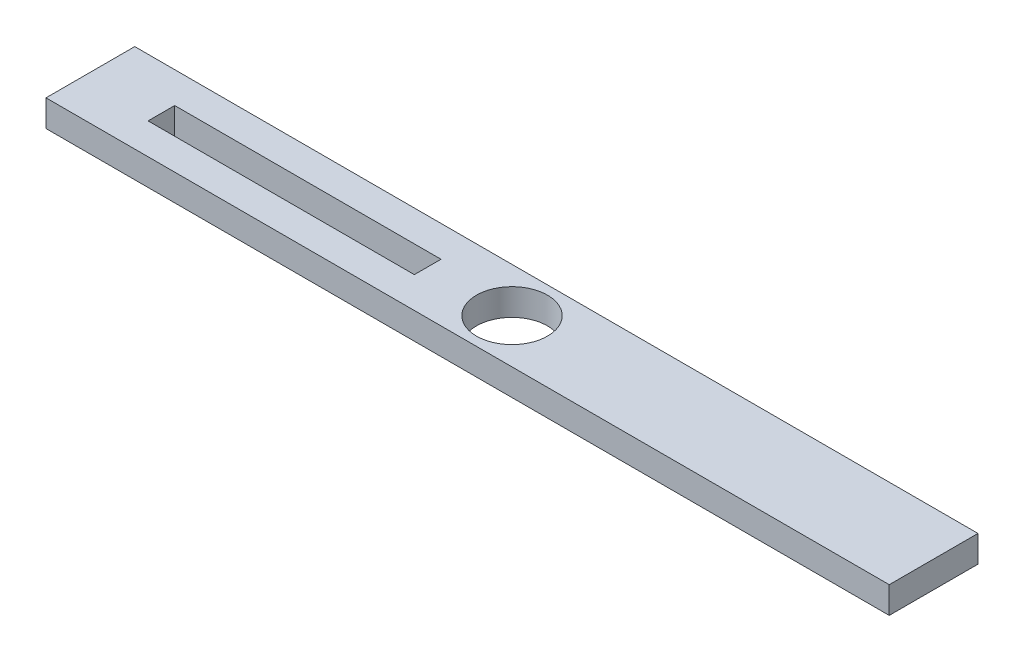
ISO-10303-21;
HEADER;
FILE_DESCRIPTION(('STEP AP214'),'2;1');
FILE_NAME('part.step','',(''),(''),'','','');
FILE_SCHEMA(('AUTOMOTIVE_DESIGN { 1 0 10303 214 1 1 1 1 }'));
ENDSEC;
DATA;
#1=APPLICATION_CONTEXT('core data for automotive mechanical design processes');
#2=APPLICATION_PROTOCOL_DEFINITION('international standard','automotive_design',2000,#1);
#3=PRODUCT_CONTEXT('',#1,'mechanical');
#4=PRODUCT('Part','Part','',(#3));
#5=PRODUCT_RELATED_PRODUCT_CATEGORY('part','',(#4));
#6=PRODUCT_DEFINITION_FORMATION('','',#4);
#7=PRODUCT_DEFINITION_CONTEXT('part definition',#1,'design');
#8=PRODUCT_DEFINITION('design','',#6,#7);
#9=PRODUCT_DEFINITION_SHAPE('','',#8);
#10=(LENGTH_UNIT() NAMED_UNIT(*) SI_UNIT(.MILLI.,.METRE.));
#11=(NAMED_UNIT(*) PLANE_ANGLE_UNIT() SI_UNIT($,.RADIAN.));
#12=(NAMED_UNIT(*) SI_UNIT($,.STERADIAN.) SOLID_ANGLE_UNIT());
#13=UNCERTAINTY_MEASURE_WITH_UNIT(LENGTH_MEASURE(1.E-05),#10,'distance_accuracy_value','');
#14=(GEOMETRIC_REPRESENTATION_CONTEXT(3) GLOBAL_UNCERTAINTY_ASSIGNED_CONTEXT((#13)) GLOBAL_UNIT_ASSIGNED_CONTEXT((#10,
#11,#12)) REPRESENTATION_CONTEXT('',''));
#15=CARTESIAN_POINT('',(0.,0.,0.));
#16=DIRECTION('',(0.,0.,1.));
#17=DIRECTION('',(1.,0.,0.));
#18=AXIS2_PLACEMENT_3D('',#15,#16,#17);
#19=CARTESIAN_POINT('',(0.,3.,0.));
#20=DIRECTION('',(0.,-1.,0.));
#21=DIRECTION('',(0.,0.,-1.));
#22=AXIS2_PLACEMENT_3D('',#19,#20,#21);
#23=PLANE('',#22);
#24=CARTESIAN_POINT('',(0.,3.,0.));
#25=DIRECTION('',(0.,1.,0.));
#26=DIRECTION('',(0.,0.,1.));
#27=AXIS2_PLACEMENT_3D('',#24,#25,#26);
#28=CIRCLE('',#27,4.);
#29=CARTESIAN_POINT('',(0.,3.,4.));
#30=VERTEX_POINT('',#29);
#31=EDGE_CURVE('E155',#30,#30,#28,.T.);
#32=ORIENTED_EDGE('',*,*,#31,.F.);
#33=EDGE_LOOP('',(#32));
#34=FACE_BOUND('',#33,.T.);
#35=DIRECTION('',(0.,0.,-1.));
#36=VECTOR('',#35,1.);
#37=CARTESIAN_POINT('',(47.5,3.,5.));
#38=LINE('',#37,#36);
#39=CARTESIAN_POINT('',(47.5,3.,5.));
#40=VERTEX_POINT('',#39);
#41=CARTESIAN_POINT('',(47.5,3.,-5.));
#42=VERTEX_POINT('',#41);
#43=EDGE_CURVE('E163',#40,#42,#38,.T.);
#44=ORIENTED_EDGE('',*,*,#43,.T.);
#45=DIRECTION('',(-1.,0.,0.));
#46=VECTOR('',#45,1.);
#47=CARTESIAN_POINT('',(-47.5,3.,-5.));
#48=LINE('',#47,#46);
#49=CARTESIAN_POINT('',(-47.5,3.,-5.));
#50=VERTEX_POINT('',#49);
#51=EDGE_CURVE('E167',#42,#50,#48,.T.);
#52=ORIENTED_EDGE('',*,*,#51,.T.);
#53=DIRECTION('',(0.,0.,1.));
#54=VECTOR('',#53,1.);
#55=CARTESIAN_POINT('',(-47.5,3.,5.));
#56=LINE('',#55,#54);
#57=CARTESIAN_POINT('',(-47.5,3.,5.));
#58=VERTEX_POINT('',#57);
#59=EDGE_CURVE('E171',#50,#58,#56,.T.);
#60=ORIENTED_EDGE('',*,*,#59,.T.);
#61=DIRECTION('',(1.,0.,0.));
#62=VECTOR('',#61,1.);
#63=CARTESIAN_POINT('',(-47.5,3.,5.));
#64=LINE('',#63,#62);
#65=EDGE_CURVE('E174',#58,#40,#64,.T.);
#66=ORIENTED_EDGE('',*,*,#65,.T.);
#67=EDGE_LOOP('',(#44,#52,#60,#66));
#68=FACE_BOUND('',#67,.T.);
#69=DIRECTION('',(0.,0.,-1.));
#70=VECTOR('',#69,1.);
#71=CARTESIAN_POINT('',(-9.50000000000001,3.,1.5));
#72=LINE('',#71,#70);
#73=CARTESIAN_POINT('',(-9.50000000000001,3.,1.5));
#74=VERTEX_POINT('',#73);
#75=CARTESIAN_POINT('',(-9.50000000000001,3.,-1.5));
#76=VERTEX_POINT('',#75);
#77=EDGE_CURVE('E107',#74,#76,#72,.T.);
#78=ORIENTED_EDGE('',*,*,#77,.F.);
#79=DIRECTION('',(1.,0.,0.));
#80=VECTOR('',#79,1.);
#81=CARTESIAN_POINT('',(-39.5,3.,1.5));
#82=LINE('',#81,#80);
#83=CARTESIAN_POINT('',(-39.5,3.,1.5));
#84=VERTEX_POINT('',#83);
#85=EDGE_CURVE('E133',#84,#74,#82,.T.);
#86=ORIENTED_EDGE('',*,*,#85,.F.);
#87=DIRECTION('',(0.,0.,1.));
#88=VECTOR('',#87,1.);
#89=CARTESIAN_POINT('',(-39.5,3.,1.5));
#90=LINE('',#89,#88);
#91=CARTESIAN_POINT('',(-39.5,3.,-1.5));
#92=VERTEX_POINT('',#91);
#93=EDGE_CURVE('E129',#92,#84,#90,.T.);
#94=ORIENTED_EDGE('',*,*,#93,.F.);
#95=DIRECTION('',(-1.,0.,0.));
#96=VECTOR('',#95,1.);
#97=CARTESIAN_POINT('',(-39.5,3.,-1.5));
#98=LINE('',#97,#96);
#99=EDGE_CURVE('E116',#76,#92,#98,.T.);
#100=ORIENTED_EDGE('',*,*,#99,.F.);
#101=EDGE_LOOP('',(#78,#86,#94,#100));
#102=FACE_BOUND('',#101,.T.);
#103=ADVANCED_FACE('F41',(#34,#68,#102),#23,.F.);
#104=CARTESIAN_POINT('',(0.,0.,0.));
#105=DIRECTION('',(0.,-1.,0.));
#106=DIRECTION('',(0.,0.,-1.));
#107=AXIS2_PLACEMENT_3D('',#104,#105,#106);
#108=PLANE('',#107);
#109=DIRECTION('',(0.,0.,-1.));
#110=VECTOR('',#109,1.);
#111=CARTESIAN_POINT('',(47.5,0.,5.));
#112=LINE('',#111,#110);
#113=CARTESIAN_POINT('',(47.5,0.,5.));
#114=VERTEX_POINT('',#113);
#115=CARTESIAN_POINT('',(47.5,0.,-5.));
#116=VERTEX_POINT('',#115);
#117=EDGE_CURVE('E159',#114,#116,#112,.T.);
#118=ORIENTED_EDGE('',*,*,#117,.F.);
#119=DIRECTION('',(1.,0.,0.));
#120=VECTOR('',#119,1.);
#121=CARTESIAN_POINT('',(-47.5,0.,5.));
#122=LINE('',#121,#120);
#123=CARTESIAN_POINT('',(-47.5,0.,5.));
#124=VERTEX_POINT('',#123);
#125=EDGE_CURVE('E168',#124,#114,#122,.T.);
#126=ORIENTED_EDGE('',*,*,#125,.F.);
#127=DIRECTION('',(0.,0.,1.));
#128=VECTOR('',#127,1.);
#129=CARTESIAN_POINT('',(-47.5,0.,5.));
#130=LINE('',#129,#128);
#131=CARTESIAN_POINT('',(-47.5,0.,-5.));
#132=VERTEX_POINT('',#131);
#133=EDGE_CURVE('E184',#132,#124,#130,.T.);
#134=ORIENTED_EDGE('',*,*,#133,.F.);
#135=DIRECTION('',(-1.,0.,0.));
#136=VECTOR('',#135,1.);
#137=CARTESIAN_POINT('',(-47.5,0.,-5.));
#138=LINE('',#137,#136);
#139=EDGE_CURVE('E181',#116,#132,#138,.T.);
#140=ORIENTED_EDGE('',*,*,#139,.F.);
#141=EDGE_LOOP('',(#118,#126,#134,#140));
#142=FACE_BOUND('',#141,.T.);
#143=CARTESIAN_POINT('',(0.,0.,0.));
#144=DIRECTION('',(0.,1.,0.));
#145=DIRECTION('',(0.,0.,1.));
#146=AXIS2_PLACEMENT_3D('',#143,#144,#145);
#147=CIRCLE('',#146,4.);
#148=CARTESIAN_POINT('',(0.,0.,4.));
#149=VERTEX_POINT('',#148);
#150=EDGE_CURVE('E125',#149,#149,#147,.T.);
#151=ORIENTED_EDGE('',*,*,#150,.T.);
#152=EDGE_LOOP('',(#151));
#153=FACE_BOUND('',#152,.T.);
#154=DIRECTION('',(1.,0.,0.));
#155=VECTOR('',#154,1.);
#156=CARTESIAN_POINT('',(-39.5,0.,1.5));
#157=LINE('',#156,#155);
#158=CARTESIAN_POINT('',(-39.5,0.,1.5));
#159=VERTEX_POINT('',#158);
#160=CARTESIAN_POINT('',(-9.50000000000001,0.,1.5));
#161=VERTEX_POINT('',#160);
#162=EDGE_CURVE('E117',#159,#161,#157,.T.);
#163=ORIENTED_EDGE('',*,*,#162,.T.);
#164=DIRECTION('',(0.,0.,-1.));
#165=VECTOR('',#164,1.);
#166=CARTESIAN_POINT('',(-9.50000000000001,0.,1.5));
#167=LINE('',#166,#165);
#168=CARTESIAN_POINT('',(-9.50000000000001,0.,-1.5));
#169=VERTEX_POINT('',#168);
#170=EDGE_CURVE('E65',#161,#169,#167,.T.);
#171=ORIENTED_EDGE('',*,*,#170,.T.);
#172=DIRECTION('',(-1.,0.,0.));
#173=VECTOR('',#172,1.);
#174=CARTESIAN_POINT('',(-39.5,0.,-1.5));
#175=LINE('',#174,#173);
#176=CARTESIAN_POINT('',(-39.5,0.,-1.5));
#177=VERTEX_POINT('',#176);
#178=EDGE_CURVE('E123',#169,#177,#175,.T.);
#179=ORIENTED_EDGE('',*,*,#178,.T.);
#180=DIRECTION('',(0.,0.,1.));
#181=VECTOR('',#180,1.);
#182=CARTESIAN_POINT('',(-39.5,0.,1.5));
#183=LINE('',#182,#181);
#184=EDGE_CURVE('E142',#177,#159,#183,.T.);
#185=ORIENTED_EDGE('',*,*,#184,.T.);
#186=EDGE_LOOP('',(#163,#171,#179,#185));
#187=FACE_BOUND('',#186,.T.);
#188=ADVANCED_FACE('F207',(#142,#153,#187),#108,.T.);
#189=CARTESIAN_POINT('',(47.5,3.,5.));
#190=DIRECTION('',(-1.,0.,0.));
#191=DIRECTION('',(0.,0.,1.));
#192=AXIS2_PLACEMENT_3D('',#189,#190,#191);
#193=PLANE('',#192);
#194=ORIENTED_EDGE('',*,*,#117,.T.);
#195=DIRECTION('',(0.,-1.,0.));
#196=VECTOR('',#195,1.);
#197=CARTESIAN_POINT('',(47.5,3.,-5.));
#198=LINE('',#197,#196);
#199=EDGE_CURVE('E11',#42,#116,#198,.T.);
#200=ORIENTED_EDGE('',*,*,#199,.F.);
#201=ORIENTED_EDGE('',*,*,#43,.F.);
#202=DIRECTION('',(0.,-1.,0.));
#203=VECTOR('',#202,1.);
#204=CARTESIAN_POINT('',(47.5,3.,5.));
#205=LINE('',#204,#203);
#206=EDGE_CURVE('E177',#40,#114,#205,.T.);
#207=ORIENTED_EDGE('',*,*,#206,.T.);
#208=EDGE_LOOP('',(#194,#200,#201,#207));
#209=FACE_BOUND('',#208,.T.);
#210=ADVANCED_FACE('F43',(#209),#193,.F.);
#211=CARTESIAN_POINT('',(-47.5,3.,-5.));
#212=DIRECTION('',(0.,0.,1.));
#213=DIRECTION('',(1.,0.,0.));
#214=AXIS2_PLACEMENT_3D('',#211,#212,#213);
#215=PLANE('',#214);
#216=ORIENTED_EDGE('',*,*,#139,.T.);
#217=DIRECTION('',(0.,-1.,0.));
#218=VECTOR('',#217,1.);
#219=CARTESIAN_POINT('',(-47.5,3.,-5.));
#220=LINE('',#219,#218);
#221=EDGE_CURVE('E50',#50,#132,#220,.T.);
#222=ORIENTED_EDGE('',*,*,#221,.F.);
#223=ORIENTED_EDGE('',*,*,#51,.F.);
#224=ORIENTED_EDGE('',*,*,#199,.T.);
#225=EDGE_LOOP('',(#216,#222,#223,#224));
#226=FACE_BOUND('',#225,.T.);
#227=ADVANCED_FACE('F217',(#226),#215,.F.);
#228=CARTESIAN_POINT('',(-47.5,3.,5.));
#229=DIRECTION('',(1.,0.,0.));
#230=DIRECTION('',(0.,0.,-1.));
#231=AXIS2_PLACEMENT_3D('',#228,#229,#230);
#232=PLANE('',#231);
#233=ORIENTED_EDGE('',*,*,#133,.T.);
#234=DIRECTION('',(0.,-1.,0.));
#235=VECTOR('',#234,1.);
#236=CARTESIAN_POINT('',(-47.5,3.,5.));
#237=LINE('',#236,#235);
#238=EDGE_CURVE('E192',#58,#124,#237,.T.);
#239=ORIENTED_EDGE('',*,*,#238,.F.);
#240=ORIENTED_EDGE('',*,*,#59,.F.);
#241=ORIENTED_EDGE('',*,*,#221,.T.);
#242=EDGE_LOOP('',(#233,#239,#240,#241));
#243=FACE_BOUND('',#242,.T.);
#244=ADVANCED_FACE('F201',(#243),#232,.F.);
#245=CARTESIAN_POINT('',(-47.5,3.,5.));
#246=DIRECTION('',(0.,0.,-1.));
#247=DIRECTION('',(-1.,0.,0.));
#248=AXIS2_PLACEMENT_3D('',#245,#246,#247);
#249=PLANE('',#248);
#250=ORIENTED_EDGE('',*,*,#125,.T.);
#251=ORIENTED_EDGE('',*,*,#206,.F.);
#252=ORIENTED_EDGE('',*,*,#65,.F.);
#253=ORIENTED_EDGE('',*,*,#238,.T.);
#254=EDGE_LOOP('',(#250,#251,#252,#253));
#255=FACE_BOUND('',#254,.T.);
#256=ADVANCED_FACE('F211',(#255),#249,.F.);
#257=CARTESIAN_POINT('',(0.,3.,0.));
#258=DIRECTION('',(0.,-1.,0.));
#259=DIRECTION('',(0.,0.,-1.));
#260=AXIS2_PLACEMENT_3D('',#257,#258,#259);
#261=CYLINDRICAL_SURFACE('',#260,4.);
#262=ORIENTED_EDGE('',*,*,#31,.T.);
#263=EDGE_LOOP('',(#262));
#264=FACE_BOUND('',#263,.T.);
#265=ORIENTED_EDGE('',*,*,#150,.F.);
#266=EDGE_LOOP('',(#265));
#267=FACE_BOUND('',#266,.T.);
#268=ADVANCED_FACE('F233',(#264,#267),#261,.F.);
#269=CARTESIAN_POINT('',(-9.50000000000001,3.,1.5));
#270=DIRECTION('',(-1.,0.,0.));
#271=DIRECTION('',(0.,0.,1.));
#272=AXIS2_PLACEMENT_3D('',#269,#270,#271);
#273=PLANE('',#272);
#274=ORIENTED_EDGE('',*,*,#170,.F.);
#275=DIRECTION('',(0.,-1.,0.));
#276=VECTOR('',#275,1.);
#277=CARTESIAN_POINT('',(-9.50000000000001,3.,1.5));
#278=LINE('',#277,#276);
#279=EDGE_CURVE('E111',#74,#161,#278,.T.);
#280=ORIENTED_EDGE('',*,*,#279,.F.);
#281=ORIENTED_EDGE('',*,*,#77,.T.);
#282=DIRECTION('',(0.,-1.,0.));
#283=VECTOR('',#282,1.);
#284=CARTESIAN_POINT('',(-9.50000000000001,3.,-1.5));
#285=LINE('',#284,#283);
#286=EDGE_CURVE('E110',#76,#169,#285,.T.);
#287=ORIENTED_EDGE('',*,*,#286,.T.);
#288=EDGE_LOOP('',(#274,#280,#281,#287));
#289=FACE_BOUND('',#288,.T.);
#290=ADVANCED_FACE('F109',(#289),#273,.T.);
#291=CARTESIAN_POINT('',(-39.5,3.,-1.5));
#292=DIRECTION('',(0.,0.,1.));
#293=DIRECTION('',(1.,0.,0.));
#294=AXIS2_PLACEMENT_3D('',#291,#292,#293);
#295=PLANE('',#294);
#296=ORIENTED_EDGE('',*,*,#178,.F.);
#297=ORIENTED_EDGE('',*,*,#286,.F.);
#298=ORIENTED_EDGE('',*,*,#99,.T.);
#299=DIRECTION('',(0.,-1.,0.));
#300=VECTOR('',#299,1.);
#301=CARTESIAN_POINT('',(-39.5,3.,-1.5));
#302=LINE('',#301,#300);
#303=EDGE_CURVE('E126',#92,#177,#302,.T.);
#304=ORIENTED_EDGE('',*,*,#303,.T.);
#305=EDGE_LOOP('',(#296,#297,#298,#304));
#306=FACE_BOUND('',#305,.T.);
#307=ADVANCED_FACE('F120',(#306),#295,.T.);
#308=CARTESIAN_POINT('',(-39.5,3.,1.5));
#309=DIRECTION('',(1.,0.,0.));
#310=DIRECTION('',(0.,0.,-1.));
#311=AXIS2_PLACEMENT_3D('',#308,#309,#310);
#312=PLANE('',#311);
#313=ORIENTED_EDGE('',*,*,#184,.F.);
#314=ORIENTED_EDGE('',*,*,#303,.F.);
#315=ORIENTED_EDGE('',*,*,#93,.T.);
#316=DIRECTION('',(0.,-1.,0.));
#317=VECTOR('',#316,1.);
#318=CARTESIAN_POINT('',(-39.5,3.,1.5));
#319=LINE('',#318,#317);
#320=EDGE_CURVE('E57',#84,#159,#319,.T.);
#321=ORIENTED_EDGE('',*,*,#320,.T.);
#322=EDGE_LOOP('',(#313,#314,#315,#321));
#323=FACE_BOUND('',#322,.T.);
#324=ADVANCED_FACE('F250',(#323),#312,.T.);
#325=CARTESIAN_POINT('',(-39.5,3.,1.5));
#326=DIRECTION('',(0.,0.,-1.));
#327=DIRECTION('',(-1.,0.,0.));
#328=AXIS2_PLACEMENT_3D('',#325,#326,#327);
#329=PLANE('',#328);
#330=ORIENTED_EDGE('',*,*,#162,.F.);
#331=ORIENTED_EDGE('',*,*,#320,.F.);
#332=ORIENTED_EDGE('',*,*,#85,.T.);
#333=ORIENTED_EDGE('',*,*,#279,.T.);
#334=EDGE_LOOP('',(#330,#331,#332,#333));
#335=FACE_BOUND('',#334,.T.);
#336=ADVANCED_FACE('F248',(#335),#329,.T.);
#337=CLOSED_SHELL('',(#103,#188,#210,#227,#244,#256,#268,#290,#307,#324,#336));
#338=MANIFOLD_SOLID_BREP('B2',#337);
#339=ADVANCED_BREP_SHAPE_REPRESENTATION('',(#18,#338),#14);
#340=SHAPE_DEFINITION_REPRESENTATION(#9,#339);
ENDSEC;
END-ISO-10303-21;
